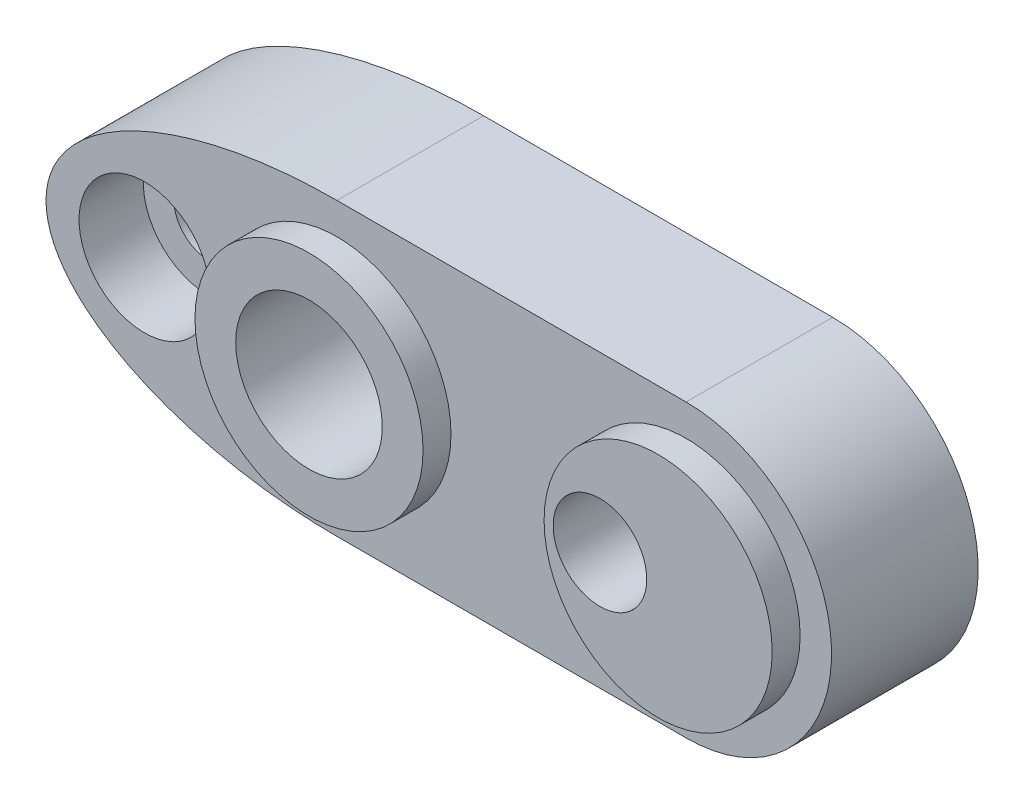
ISO-10303-21;
HEADER;
FILE_DESCRIPTION(('STEP AP214'),'2;1');
FILE_NAME('part.step','',(''),(''),'','','');
FILE_SCHEMA(('AUTOMOTIVE_DESIGN { 1 0 10303 214 1 1 1 1 }'));
ENDSEC;
DATA;
#1=APPLICATION_CONTEXT('core data for automotive mechanical design processes');
#2=APPLICATION_PROTOCOL_DEFINITION('international standard','automotive_design',2000,#1);
#3=PRODUCT_CONTEXT('',#1,'mechanical');
#4=PRODUCT('Part','Part','',(#3));
#5=PRODUCT_RELATED_PRODUCT_CATEGORY('part','',(#4));
#6=PRODUCT_DEFINITION_FORMATION('','',#4);
#7=PRODUCT_DEFINITION_CONTEXT('part definition',#1,'design');
#8=PRODUCT_DEFINITION('design','',#6,#7);
#9=PRODUCT_DEFINITION_SHAPE('','',#8);
#10=(LENGTH_UNIT() NAMED_UNIT(*) SI_UNIT(.MILLI.,.METRE.));
#11=(NAMED_UNIT(*) PLANE_ANGLE_UNIT() SI_UNIT($,.RADIAN.));
#12=(NAMED_UNIT(*) SI_UNIT($,.STERADIAN.) SOLID_ANGLE_UNIT());
#13=UNCERTAINTY_MEASURE_WITH_UNIT(LENGTH_MEASURE(1.E-05),#10,'distance_accuracy_value','');
#14=(GEOMETRIC_REPRESENTATION_CONTEXT(3) GLOBAL_UNCERTAINTY_ASSIGNED_CONTEXT((#13)) GLOBAL_UNIT_ASSIGNED_CONTEXT((#10,
#11,#12)) REPRESENTATION_CONTEXT('',''));
#15=CARTESIAN_POINT('',(0.,0.,0.));
#16=DIRECTION('',(0.,0.,1.));
#17=DIRECTION('',(1.,0.,0.));
#18=AXIS2_PLACEMENT_3D('',#15,#16,#17);
#19=CARTESIAN_POINT('',(0.,0.,-9.525));
#20=DIRECTION('',(0.,0.,1.));
#21=DIRECTION('',(-1.,0.,0.));
#22=AXIS2_PLACEMENT_3D('',#19,#20,#21);
#23=ELLIPSE('',#22,15.875,7.9375);
#24=DIRECTION('',(0.,0.,1.));
#25=VECTOR('',#24,1.);
#26=SURFACE_OF_LINEAR_EXTRUSION('',#23,#25);
#27=DIRECTION('',(0.,0.,1.));
#28=VECTOR('',#27,1.);
#29=CARTESIAN_POINT('',(0.,-7.9375,-9.525));
#30=LINE('',#29,#28);
#31=CARTESIAN_POINT('',(0.,-7.9375,-9.525));
#32=VERTEX_POINT('',#31);
#33=CARTESIAN_POINT('',(0.,-7.9375,-1.524));
#34=VERTEX_POINT('',#33);
#35=EDGE_CURVE('E99',#32,#34,#30,.T.);
#36=ORIENTED_EDGE('',*,*,#35,.T.);
#37=CARTESIAN_POINT('',(0.,0.,-1.524));
#38=DIRECTION('',(0.,0.,1.));
#39=DIRECTION('',(-1.,0.,0.));
#40=AXIS2_PLACEMENT_3D('',#37,#38,#39);
#41=ELLIPSE('',#40,15.875,7.9375);
#42=CARTESIAN_POINT('',(0.,7.9375,-1.524));
#43=VERTEX_POINT('',#42);
#44=EDGE_CURVE('E55',#34,#43,#41,.F.);
#45=ORIENTED_EDGE('',*,*,#44,.T.);
#46=DIRECTION('',(0.,0.,1.));
#47=VECTOR('',#46,1.);
#48=CARTESIAN_POINT('',(0.,7.9375,-9.525));
#49=LINE('',#48,#47);
#50=CARTESIAN_POINT('',(0.,7.9375,-9.525));
#51=VERTEX_POINT('',#50);
#52=EDGE_CURVE('E48',#51,#43,#49,.T.);
#53=ORIENTED_EDGE('',*,*,#52,.F.);
#54=EDGE_CURVE('E109',#51,#32,#23,.T.);
#55=ORIENTED_EDGE('',*,*,#54,.T.);
#56=EDGE_LOOP('',(#36,#45,#53,#55));
#57=FACE_BOUND('',#56,.T.);
#58=ADVANCED_FACE('F40',(#57),#26,.T.);
#59=CARTESIAN_POINT('',(0.,7.9375,-9.525));
#60=DIRECTION('',(0.,1.,0.));
#61=DIRECTION('',(0.,0.,1.));
#62=AXIS2_PLACEMENT_3D('',#59,#60,#61);
#63=PLANE('',#62);
#64=ORIENTED_EDGE('',*,*,#52,.T.);
#65=DIRECTION('',(1.,0.,0.));
#66=VECTOR('',#65,1.);
#67=CARTESIAN_POINT('',(0.,7.9375,-1.524));
#68=LINE('',#67,#66);
#69=CARTESIAN_POINT('',(19.05,7.9375,-1.524));
#70=VERTEX_POINT('',#69);
#71=EDGE_CURVE('E92',#43,#70,#68,.T.);
#72=ORIENTED_EDGE('',*,*,#71,.T.);
#73=DIRECTION('',(0.,0.,1.));
#74=VECTOR('',#73,1.);
#75=CARTESIAN_POINT('',(19.05,7.9375,-9.525));
#76=LINE('',#75,#74);
#77=CARTESIAN_POINT('',(19.05,7.9375,-9.525));
#78=VERTEX_POINT('',#77);
#79=EDGE_CURVE('E91',#78,#70,#76,.T.);
#80=ORIENTED_EDGE('',*,*,#79,.F.);
#81=DIRECTION('',(-1.,0.,0.));
#82=VECTOR('',#81,1.);
#83=CARTESIAN_POINT('',(0.,7.9375,-9.525));
#84=LINE('',#83,#82);
#85=EDGE_CURVE('E102',#78,#51,#84,.T.);
#86=ORIENTED_EDGE('',*,*,#85,.T.);
#87=EDGE_LOOP('',(#64,#72,#80,#86));
#88=FACE_BOUND('',#87,.T.);
#89=ADVANCED_FACE('F178',(#88),#63,.T.);
#90=CARTESIAN_POINT('',(19.05,0.,-9.525));
#91=DIRECTION('',(0.,0.,1.));
#92=DIRECTION('',(1.,0.,0.));
#93=AXIS2_PLACEMENT_3D('',#90,#91,#92);
#94=CYLINDRICAL_SURFACE('',#93,7.9375);
#95=ORIENTED_EDGE('',*,*,#79,.T.);
#96=CARTESIAN_POINT('',(19.05,0.,-1.524));
#97=DIRECTION('',(0.,0.,1.));
#98=DIRECTION('',(1.,0.,0.));
#99=AXIS2_PLACEMENT_3D('',#96,#97,#98);
#100=CIRCLE('',#99,7.9375);
#101=CARTESIAN_POINT('',(19.05,-7.9375,-1.524));
#102=VERTEX_POINT('',#101);
#103=EDGE_CURVE('E80',#70,#102,#100,.F.);
#104=ORIENTED_EDGE('',*,*,#103,.T.);
#105=DIRECTION('',(0.,0.,1.));
#106=VECTOR('',#105,1.);
#107=CARTESIAN_POINT('',(19.05,-7.9375,-9.525));
#108=LINE('',#107,#106);
#109=CARTESIAN_POINT('',(19.05,-7.9375,-9.525));
#110=VERTEX_POINT('',#109);
#111=EDGE_CURVE('E89',#110,#102,#108,.T.);
#112=ORIENTED_EDGE('',*,*,#111,.F.);
#113=CARTESIAN_POINT('',(19.05,0.,-9.525));
#114=DIRECTION('',(0.,0.,1.));
#115=DIRECTION('',(1.,0.,0.));
#116=AXIS2_PLACEMENT_3D('',#113,#114,#115);
#117=CIRCLE('',#116,7.9375);
#118=EDGE_CURVE('E107',#110,#78,#117,.T.);
#119=ORIENTED_EDGE('',*,*,#118,.T.);
#120=EDGE_LOOP('',(#95,#104,#112,#119));
#121=FACE_BOUND('',#120,.T.);
#122=ADVANCED_FACE('F87',(#121),#94,.T.);
#123=CARTESIAN_POINT('',(0.,-7.9375,-9.525));
#124=DIRECTION('',(0.,-1.,0.));
#125=DIRECTION('',(0.,0.,-1.));
#126=AXIS2_PLACEMENT_3D('',#123,#124,#125);
#127=PLANE('',#126);
#128=ORIENTED_EDGE('',*,*,#111,.T.);
#129=DIRECTION('',(-1.,0.,0.));
#130=VECTOR('',#129,1.);
#131=CARTESIAN_POINT('',(0.,-7.9375,-1.524));
#132=LINE('',#131,#130);
#133=EDGE_CURVE('E12',#102,#34,#132,.T.);
#134=ORIENTED_EDGE('',*,*,#133,.T.);
#135=ORIENTED_EDGE('',*,*,#35,.F.);
#136=DIRECTION('',(1.,0.,0.));
#137=VECTOR('',#136,1.);
#138=CARTESIAN_POINT('',(0.,-7.9375,-9.525));
#139=LINE('',#138,#137);
#140=EDGE_CURVE('E98',#32,#110,#139,.T.);
#141=ORIENTED_EDGE('',*,*,#140,.T.);
#142=EDGE_LOOP('',(#128,#134,#135,#141));
#143=FACE_BOUND('',#142,.T.);
#144=ADVANCED_FACE('F96',(#143),#127,.T.);
#145=CARTESIAN_POINT('',(0.,0.,-9.525));
#146=DIRECTION('',(0.,0.,1.));
#147=DIRECTION('',(1.,0.,0.));
#148=AXIS2_PLACEMENT_3D('',#145,#146,#147);
#149=PLANE('',#148);
#150=CARTESIAN_POINT('',(15.875,0.,-9.525));
#151=DIRECTION('',(0.,0.,1.));
#152=DIRECTION('',(1.,0.,0.));
#153=AXIS2_PLACEMENT_3D('',#150,#151,#152);
#154=CIRCLE('',#153,2.5527);
#155=CARTESIAN_POINT('',(18.4277,0.,-9.525));
#156=VERTEX_POINT('',#155);
#157=EDGE_CURVE('E147',#156,#156,#154,.T.);
#158=ORIENTED_EDGE('',*,*,#157,.T.);
#159=EDGE_LOOP('',(#158));
#160=FACE_BOUND('',#159,.T.);
#161=CARTESIAN_POINT('',(-10.5,0.,-9.525));
#162=DIRECTION('',(0.,0.,1.));
#163=DIRECTION('',(1.,0.,0.));
#164=AXIS2_PLACEMENT_3D('',#161,#162,#163);
#165=CIRCLE('',#164,1.89865);
#166=CARTESIAN_POINT('',(-8.60135,0.,-9.525));
#167=VERTEX_POINT('',#166);
#168=EDGE_CURVE('E132',#167,#167,#165,.T.);
#169=ORIENTED_EDGE('',*,*,#168,.T.);
#170=EDGE_LOOP('',(#169));
#171=FACE_BOUND('',#170,.T.);
#172=CARTESIAN_POINT('',(0.,0.,-9.525));
#173=DIRECTION('',(0.,0.,-1.));
#174=DIRECTION('',(-1.,0.,0.));
#175=AXIS2_PLACEMENT_3D('',#172,#173,#174);
#176=CIRCLE('',#175,4.);
#177=CARTESIAN_POINT('',(-4.,0.,-9.525));
#178=VERTEX_POINT('',#177);
#179=EDGE_CURVE('E128',#178,#178,#176,.T.);
#180=ORIENTED_EDGE('',*,*,#179,.F.);
#181=EDGE_LOOP('',(#180));
#182=FACE_BOUND('',#181,.T.);
#183=ORIENTED_EDGE('',*,*,#54,.F.);
#184=ORIENTED_EDGE('',*,*,#85,.F.);
#185=ORIENTED_EDGE('',*,*,#118,.F.);
#186=ORIENTED_EDGE('',*,*,#140,.F.);
#187=EDGE_LOOP('',(#183,#184,#185,#186));
#188=FACE_BOUND('',#187,.T.);
#189=ADVANCED_FACE('F185',(#160,#171,#182,#188),#149,.F.);
#190=CARTESIAN_POINT('',(5.55625,0.,-1.524));
#191=DIRECTION('',(0.,0.,1.));
#192=DIRECTION('',(1.,0.,0.));
#193=AXIS2_PLACEMENT_3D('',#190,#191,#192);
#194=PLANE('',#193);
#195=CARTESIAN_POINT('',(-10.5,0.,-1.524));
#196=DIRECTION('',(0.,0.,1.));
#197=DIRECTION('',(1.,0.,0.));
#198=AXIS2_PLACEMENT_3D('',#195,#196,#197);
#199=CIRCLE('',#198,3.57251);
#200=CARTESIAN_POINT('',(-6.92749,0.,-1.524));
#201=VERTEX_POINT('',#200);
#202=EDGE_CURVE('E144',#201,#201,#199,.T.);
#203=ORIENTED_EDGE('',*,*,#202,.F.);
#204=EDGE_LOOP('',(#203));
#205=FACE_BOUND('',#204,.T.);
#206=ORIENTED_EDGE('',*,*,#133,.F.);
#207=ORIENTED_EDGE('',*,*,#103,.F.);
#208=ORIENTED_EDGE('',*,*,#71,.F.);
#209=ORIENTED_EDGE('',*,*,#44,.F.);
#210=EDGE_LOOP('',(#206,#207,#208,#209));
#211=FACE_BOUND('',#210,.T.);
#212=CARTESIAN_POINT('',(19.05,0.,-1.524));
#213=DIRECTION('',(0.,0.,1.));
#214=DIRECTION('',(1.,0.,0.));
#215=AXIS2_PLACEMENT_3D('',#212,#213,#214);
#216=CIRCLE('',#215,6.223);
#217=CARTESIAN_POINT('',(25.273,0.,-1.524));
#218=VERTEX_POINT('',#217);
#219=EDGE_CURVE('E118',#218,#218,#216,.T.);
#220=ORIENTED_EDGE('',*,*,#219,.F.);
#221=EDGE_LOOP('',(#220));
#222=FACE_BOUND('',#221,.T.);
#223=CARTESIAN_POINT('',(0.,0.,-1.524));
#224=DIRECTION('',(0.,0.,1.));
#225=DIRECTION('',(1.,0.,0.));
#226=AXIS2_PLACEMENT_3D('',#223,#224,#225);
#227=CIRCLE('',#226,6.223);
#228=CARTESIAN_POINT('',(6.223,0.,-1.524));
#229=VERTEX_POINT('',#228);
#230=EDGE_CURVE('E93',#229,#229,#227,.T.);
#231=ORIENTED_EDGE('',*,*,#230,.F.);
#232=EDGE_LOOP('',(#231));
#233=FACE_BOUND('',#232,.T.);
#234=ADVANCED_FACE('F78',(#205,#211,#222,#233),#194,.T.);
#235=CARTESIAN_POINT('',(0.,0.,-1.524));
#236=DIRECTION('',(0.,0.,1.));
#237=DIRECTION('',(1.,0.,0.));
#238=AXIS2_PLACEMENT_3D('',#235,#236,#237);
#239=CYLINDRICAL_SURFACE('',#238,6.223);
#240=ORIENTED_EDGE('',*,*,#230,.T.);
#241=EDGE_LOOP('',(#240));
#242=FACE_BOUND('',#241,.T.);
#243=CARTESIAN_POINT('',(0.,0.,0.));
#244=DIRECTION('',(0.,0.,1.));
#245=DIRECTION('',(1.,0.,0.));
#246=AXIS2_PLACEMENT_3D('',#243,#244,#245);
#247=CIRCLE('',#246,6.223);
#248=CARTESIAN_POINT('',(6.223,0.,0.));
#249=VERTEX_POINT('',#248);
#250=EDGE_CURVE('E114',#249,#249,#247,.T.);
#251=ORIENTED_EDGE('',*,*,#250,.F.);
#252=EDGE_LOOP('',(#251));
#253=FACE_BOUND('',#252,.T.);
#254=ADVANCED_FACE('F166',(#242,#253),#239,.T.);
#255=CARTESIAN_POINT('',(19.05,0.,-1.524));
#256=DIRECTION('',(0.,0.,1.));
#257=DIRECTION('',(1.,0.,0.));
#258=AXIS2_PLACEMENT_3D('',#255,#256,#257);
#259=CYLINDRICAL_SURFACE('',#258,6.223);
#260=ORIENTED_EDGE('',*,*,#219,.T.);
#261=EDGE_LOOP('',(#260));
#262=FACE_BOUND('',#261,.T.);
#263=CARTESIAN_POINT('',(19.05,0.,0.));
#264=DIRECTION('',(0.,0.,1.));
#265=DIRECTION('',(1.,0.,0.));
#266=AXIS2_PLACEMENT_3D('',#263,#264,#265);
#267=CIRCLE('',#266,6.223);
#268=CARTESIAN_POINT('',(25.273,0.,0.));
#269=VERTEX_POINT('',#268);
#270=EDGE_CURVE('E122',#269,#269,#267,.T.);
#271=ORIENTED_EDGE('',*,*,#270,.F.);
#272=EDGE_LOOP('',(#271));
#273=FACE_BOUND('',#272,.T.);
#274=ADVANCED_FACE('F164',(#262,#273),#259,.T.);
#275=CARTESIAN_POINT('',(0.,0.,0.));
#276=DIRECTION('',(0.,0.,1.));
#277=DIRECTION('',(1.,0.,0.));
#278=AXIS2_PLACEMENT_3D('',#275,#276,#277);
#279=PLANE('',#278);
#280=CARTESIAN_POINT('',(0.,0.,0.));
#281=DIRECTION('',(0.,0.,-1.));
#282=DIRECTION('',(-1.,0.,0.));
#283=AXIS2_PLACEMENT_3D('',#280,#281,#282);
#284=CIRCLE('',#283,4.);
#285=CARTESIAN_POINT('',(-4.,0.,0.));
#286=VERTEX_POINT('',#285);
#287=EDGE_CURVE('E125',#286,#286,#284,.T.);
#288=ORIENTED_EDGE('',*,*,#287,.T.);
#289=EDGE_LOOP('',(#288));
#290=FACE_BOUND('',#289,.T.);
#291=ORIENTED_EDGE('',*,*,#250,.T.);
#292=EDGE_LOOP('',(#291));
#293=FACE_BOUND('',#292,.T.);
#294=ADVANCED_FACE('F160',(#290,#293),#279,.T.);
#295=CARTESIAN_POINT('',(15.875,0.,0.));
#296=DIRECTION('',(0.,0.,1.));
#297=DIRECTION('',(1.,0.,0.));
#298=AXIS2_PLACEMENT_3D('',#295,#296,#297);
#299=CIRCLE('',#298,2.5527);
#300=CARTESIAN_POINT('',(18.4277,0.,0.));
#301=VERTEX_POINT('',#300);
#302=EDGE_CURVE('E150',#301,#301,#299,.T.);
#303=ORIENTED_EDGE('',*,*,#302,.F.);
#304=EDGE_LOOP('',(#303));
#305=FACE_BOUND('',#304,.T.);
#306=ORIENTED_EDGE('',*,*,#270,.T.);
#307=EDGE_LOOP('',(#306));
#308=FACE_BOUND('',#307,.T.);
#309=ADVANCED_FACE('F156',(#305,#308),#279,.T.);
#310=CARTESIAN_POINT('',(0.,0.,0.));
#311=DIRECTION('',(0.,0.,-1.));
#312=DIRECTION('',(-1.,0.,0.));
#313=AXIS2_PLACEMENT_3D('',#310,#311,#312);
#314=CYLINDRICAL_SURFACE('',#313,4.);
#315=ORIENTED_EDGE('',*,*,#287,.F.);
#316=EDGE_LOOP('',(#315));
#317=FACE_BOUND('',#316,.T.);
#318=ORIENTED_EDGE('',*,*,#179,.T.);
#319=EDGE_LOOP('',(#318));
#320=FACE_BOUND('',#319,.T.);
#321=ADVANCED_FACE('F159',(#317,#320),#314,.F.);
#322=CARTESIAN_POINT('',(-10.5,0.,-1.524));
#323=DIRECTION('',(0.,0.,1.));
#324=DIRECTION('',(1.,0.,0.));
#325=AXIS2_PLACEMENT_3D('',#322,#323,#324);
#326=CYLINDRICAL_SURFACE('',#325,1.89865);
#327=ORIENTED_EDGE('',*,*,#168,.F.);
#328=EDGE_LOOP('',(#327));
#329=FACE_BOUND('',#328,.T.);
#330=CARTESIAN_POINT('',(-10.5,0.,-5.0292));
#331=DIRECTION('',(0.,0.,1.));
#332=DIRECTION('',(1.,0.,0.));
#333=AXIS2_PLACEMENT_3D('',#330,#331,#332);
#334=CIRCLE('',#333,1.89865);
#335=CARTESIAN_POINT('',(-8.60135,0.,-5.0292));
#336=VERTEX_POINT('',#335);
#337=EDGE_CURVE('E138',#336,#336,#334,.T.);
#338=ORIENTED_EDGE('',*,*,#337,.T.);
#339=EDGE_LOOP('',(#338));
#340=FACE_BOUND('',#339,.T.);
#341=ADVANCED_FACE('F235',(#329,#340),#326,.F.);
#342=CARTESIAN_POINT('',(-8.60135,0.,-5.0292));
#343=DIRECTION('',(0.,0.,-1.));
#344=DIRECTION('',(-1.,0.,0.));
#345=AXIS2_PLACEMENT_3D('',#342,#343,#344);
#346=PLANE('',#345);
#347=ORIENTED_EDGE('',*,*,#337,.F.);
#348=EDGE_LOOP('',(#347));
#349=FACE_BOUND('',#348,.T.);
#350=CARTESIAN_POINT('',(-10.5,0.,-5.0292));
#351=DIRECTION('',(0.,0.,1.));
#352=DIRECTION('',(1.,0.,0.));
#353=AXIS2_PLACEMENT_3D('',#350,#351,#352);
#354=CIRCLE('',#353,3.57251);
#355=CARTESIAN_POINT('',(-6.92749,0.,-5.0292));
#356=VERTEX_POINT('',#355);
#357=EDGE_CURVE('E141',#356,#356,#354,.T.);
#358=ORIENTED_EDGE('',*,*,#357,.T.);
#359=EDGE_LOOP('',(#358));
#360=FACE_BOUND('',#359,.T.);
#361=ADVANCED_FACE('F249',(#349,#360),#346,.F.);
#362=CARTESIAN_POINT('',(-10.5,0.,-1.524));
#363=DIRECTION('',(0.,0.,1.));
#364=DIRECTION('',(1.,0.,0.));
#365=AXIS2_PLACEMENT_3D('',#362,#363,#364);
#366=CYLINDRICAL_SURFACE('',#365,3.57251);
#367=ORIENTED_EDGE('',*,*,#357,.F.);
#368=EDGE_LOOP('',(#367));
#369=FACE_BOUND('',#368,.T.);
#370=ORIENTED_EDGE('',*,*,#202,.T.);
#371=EDGE_LOOP('',(#370));
#372=FACE_BOUND('',#371,.T.);
#373=ADVANCED_FACE('F259',(#369,#372),#366,.F.);
#374=CARTESIAN_POINT('',(15.875,0.,0.));
#375=DIRECTION('',(0.,0.,1.));
#376=DIRECTION('',(1.,0.,0.));
#377=AXIS2_PLACEMENT_3D('',#374,#375,#376);
#378=CYLINDRICAL_SURFACE('',#377,2.5527);
#379=ORIENTED_EDGE('',*,*,#157,.F.);
#380=EDGE_LOOP('',(#379));
#381=FACE_BOUND('',#380,.T.);
#382=ORIENTED_EDGE('',*,*,#302,.T.);
#383=EDGE_LOOP('',(#382));
#384=FACE_BOUND('',#383,.T.);
#385=ADVANCED_FACE('F154',(#381,#384),#378,.F.);
#386=CLOSED_SHELL('',(#58,#89,#122,#144,#189,#234,#254,#274,#294,#309,#321,#341,#361,#373,#385));
#387=MANIFOLD_SOLID_BREP('B2',#386);
#388=ADVANCED_BREP_SHAPE_REPRESENTATION('',(#18,#387),#14);
#389=SHAPE_DEFINITION_REPRESENTATION(#9,#388);
ENDSEC;
END-ISO-10303-21;
